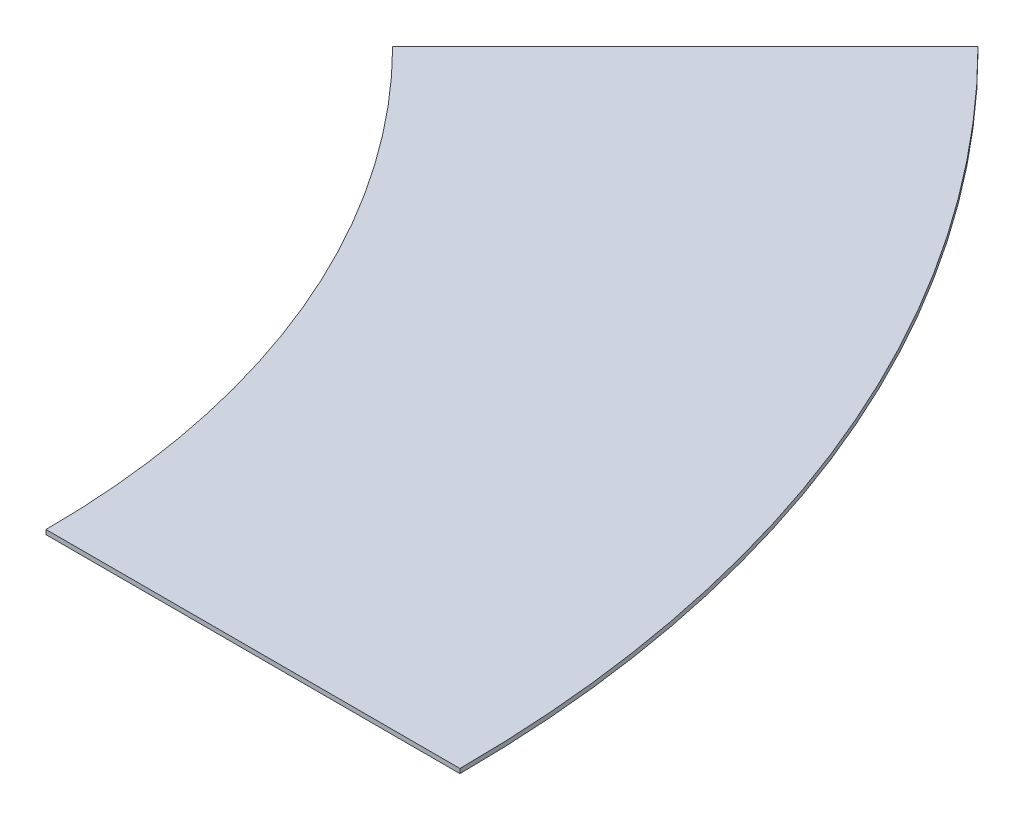
ISO-10303-21;
HEADER;
FILE_DESCRIPTION(('STEP AP214'),'2;1');
FILE_NAME('part.step','',(''),(''),'','','');
FILE_SCHEMA(('AUTOMOTIVE_DESIGN { 1 0 10303 214 1 1 1 1 }'));
ENDSEC;
DATA;
#1=APPLICATION_CONTEXT('core data for automotive mechanical design processes');
#2=APPLICATION_PROTOCOL_DEFINITION('international standard','automotive_design',2000,#1);
#3=PRODUCT_CONTEXT('',#1,'mechanical');
#4=PRODUCT('Part','Part','',(#3));
#5=PRODUCT_RELATED_PRODUCT_CATEGORY('part','',(#4));
#6=PRODUCT_DEFINITION_FORMATION('','',#4);
#7=PRODUCT_DEFINITION_CONTEXT('part definition',#1,'design');
#8=PRODUCT_DEFINITION('design','',#6,#7);
#9=PRODUCT_DEFINITION_SHAPE('','',#8);
#10=(LENGTH_UNIT() NAMED_UNIT(*) SI_UNIT(.MILLI.,.METRE.));
#11=(NAMED_UNIT(*) PLANE_ANGLE_UNIT() SI_UNIT($,.RADIAN.));
#12=(NAMED_UNIT(*) SI_UNIT($,.STERADIAN.) SOLID_ANGLE_UNIT());
#13=UNCERTAINTY_MEASURE_WITH_UNIT(LENGTH_MEASURE(1.E-05),#10,'distance_accuracy_value','');
#14=(GEOMETRIC_REPRESENTATION_CONTEXT(3) GLOBAL_UNCERTAINTY_ASSIGNED_CONTEXT((#13)) GLOBAL_UNIT_ASSIGNED_CONTEXT((#10,
#11,#12)) REPRESENTATION_CONTEXT('',''));
#15=CARTESIAN_POINT('',(0.,0.,0.));
#16=DIRECTION('',(0.,0.,1.));
#17=DIRECTION('',(1.,0.,0.));
#18=AXIS2_PLACEMENT_3D('',#15,#16,#17);
#19=CARTESIAN_POINT('',(0.,0.,0.));
#20=DIRECTION('',(0.,-1.,0.));
#21=DIRECTION('',(0.,0.,-1.));
#22=AXIS2_PLACEMENT_3D('',#19,#20,#21);
#23=CYLINDRICAL_SURFACE('',#22,930.);
#24=CARTESIAN_POINT('',(0.,2.49999999999999,0.));
#25=DIRECTION('',(0.,-1.,0.));
#26=DIRECTION('',(0.,0.,-1.));
#27=AXIS2_PLACEMENT_3D('',#24,#25,#26);
#28=CIRCLE('',#27,930.);
#29=CARTESIAN_POINT('',(657.609306503488,2.49999999999999,-657.60930650349));
#30=VERTEX_POINT('',#29);
#31=CARTESIAN_POINT('',(930.,2.49999999999999,0.));
#32=VERTEX_POINT('',#31);
#33=EDGE_CURVE('E11',#30,#32,#28,.T.);
#34=ORIENTED_EDGE('',*,*,#33,.F.);
#35=DIRECTION('',(0.,-1.,0.));
#36=VECTOR('',#35,1.);
#37=CARTESIAN_POINT('',(657.609306503488,2.49999999999999,-657.60930650349));
#38=LINE('',#37,#36);
#39=CARTESIAN_POINT('',(657.609306503488,-2.5,-657.60930650349));
#40=VERTEX_POINT('',#39);
#41=EDGE_CURVE('E87',#30,#40,#38,.T.);
#42=ORIENTED_EDGE('',*,*,#41,.T.);
#43=CARTESIAN_POINT('',(0.,-2.5,0.));
#44=DIRECTION('',(0.,-1.,0.));
#45=DIRECTION('',(0.,0.,-1.));
#46=AXIS2_PLACEMENT_3D('',#43,#44,#45);
#47=CIRCLE('',#46,930.);
#48=CARTESIAN_POINT('',(930.,-2.5,0.));
#49=VERTEX_POINT('',#48);
#50=EDGE_CURVE('E82',#40,#49,#47,.T.);
#51=ORIENTED_EDGE('',*,*,#50,.T.);
#52=DIRECTION('',(0.,-1.,0.));
#53=VECTOR('',#52,1.);
#54=CARTESIAN_POINT('',(930.,2.49999999999999,0.));
#55=LINE('',#54,#53);
#56=EDGE_CURVE('E85',#32,#49,#55,.T.);
#57=ORIENTED_EDGE('',*,*,#56,.F.);
#58=EDGE_LOOP('',(#34,#42,#51,#57));
#59=FACE_BOUND('',#58,.T.);
#60=ADVANCED_FACE('F45',(#59),#23,.F.);
#61=CARTESIAN_POINT('',(657.609306503488,2.49999999999999,-657.60930650349));
#62=DIRECTION('',(0.,-1.,0.));
#63=DIRECTION('',(0.,0.,-1.));
#64=AXIS2_PLACEMENT_3D('',#61,#62,#63);
#65=PLANE('',#64);
#66=CARTESIAN_POINT('',(0.,2.49999999999999,0.));
#67=DIRECTION('',(0.,-1.,0.));
#68=DIRECTION('',(0.,0.,-1.));
#69=AXIS2_PLACEMENT_3D('',#66,#67,#68);
#70=CIRCLE('',#69,1390.);
#71=CARTESIAN_POINT('',(982.8784258493,2.49999999999999,-982.878425849303));
#72=VERTEX_POINT('',#71);
#73=CARTESIAN_POINT('',(1390.,2.49999999999999,0.));
#74=VERTEX_POINT('',#73);
#75=EDGE_CURVE('E54',#72,#74,#70,.T.);
#76=ORIENTED_EDGE('',*,*,#75,.F.);
#77=DIRECTION('',(0.707106781186546,0.,-0.707106781186549));
#78=VECTOR('',#77,1.);
#79=CARTESIAN_POINT('',(657.609306503488,2.49999999999999,-657.60930650349));
#80=LINE('',#79,#78);
#81=EDGE_CURVE('E93',#30,#72,#80,.T.);
#82=ORIENTED_EDGE('',*,*,#81,.F.);
#83=ORIENTED_EDGE('',*,*,#33,.T.);
#84=DIRECTION('',(1.,0.,0.));
#85=VECTOR('',#84,1.);
#86=CARTESIAN_POINT('',(930.,2.49999999999999,0.));
#87=LINE('',#86,#85);
#88=EDGE_CURVE('E106',#32,#74,#87,.T.);
#89=ORIENTED_EDGE('',*,*,#88,.T.);
#90=EDGE_LOOP('',(#76,#82,#83,#89));
#91=FACE_BOUND('',#90,.T.);
#92=ADVANCED_FACE('F47',(#91),#65,.F.);
#93=CARTESIAN_POINT('',(0.,0.,0.));
#94=DIRECTION('',(0.,-1.,0.));
#95=DIRECTION('',(0.,0.,-1.));
#96=AXIS2_PLACEMENT_3D('',#93,#94,#95);
#97=CYLINDRICAL_SURFACE('',#96,1390.);
#98=CARTESIAN_POINT('',(0.,-2.49999999999971,0.));
#99=DIRECTION('',(0.,-1.,0.));
#100=DIRECTION('',(0.,0.,-1.));
#101=AXIS2_PLACEMENT_3D('',#98,#99,#100);
#102=CIRCLE('',#101,1390.);
#103=CARTESIAN_POINT('',(982.8784258493,-2.49999999999971,-982.878425849303));
#104=VERTEX_POINT('',#103);
#105=CARTESIAN_POINT('',(1390.,-2.49999999999971,0.));
#106=VERTEX_POINT('',#105);
#107=EDGE_CURVE('E92',#104,#106,#102,.T.);
#108=ORIENTED_EDGE('',*,*,#107,.F.);
#109=DIRECTION('',(0.,-1.,0.));
#110=VECTOR('',#109,1.);
#111=CARTESIAN_POINT('',(982.8784258493,2.49999999999999,-982.878425849303));
#112=LINE('',#111,#110);
#113=EDGE_CURVE('E119',#72,#104,#112,.T.);
#114=ORIENTED_EDGE('',*,*,#113,.F.);
#115=ORIENTED_EDGE('',*,*,#75,.T.);
#116=DIRECTION('',(0.,-1.,0.));
#117=VECTOR('',#116,1.);
#118=CARTESIAN_POINT('',(1390.,2.49999999999999,0.));
#119=LINE('',#118,#117);
#120=EDGE_CURVE('E102',#74,#106,#119,.T.);
#121=ORIENTED_EDGE('',*,*,#120,.T.);
#122=EDGE_LOOP('',(#108,#114,#115,#121));
#123=FACE_BOUND('',#122,.T.);
#124=ADVANCED_FACE('F129',(#123),#97,.T.);
#125=CARTESIAN_POINT('',(982.8784258493,-2.49999999999986,-982.878425849303));
#126=DIRECTION('',(0.,1.,0.));
#127=DIRECTION('',(0.,0.,1.));
#128=AXIS2_PLACEMENT_3D('',#125,#126,#127);
#129=PLANE('',#128);
#130=DIRECTION('',(-0.707106781186546,0.,0.707106781186549));
#131=VECTOR('',#130,1.);
#132=CARTESIAN_POINT('',(982.8784258493,-2.49999999999971,-982.878425849303));
#133=LINE('',#132,#131);
#134=EDGE_CURVE('E116',#104,#40,#133,.T.);
#135=ORIENTED_EDGE('',*,*,#134,.F.);
#136=ORIENTED_EDGE('',*,*,#107,.T.);
#137=DIRECTION('',(-1.,0.,0.));
#138=VECTOR('',#137,1.);
#139=CARTESIAN_POINT('',(1390.,-2.49999999999971,0.));
#140=LINE('',#139,#138);
#141=EDGE_CURVE('E96',#106,#49,#140,.T.);
#142=ORIENTED_EDGE('',*,*,#141,.T.);
#143=ORIENTED_EDGE('',*,*,#50,.F.);
#144=EDGE_LOOP('',(#135,#136,#142,#143));
#145=FACE_BOUND('',#144,.T.);
#146=ADVANCED_FACE('F97',(#145),#129,.F.);
#147=CARTESIAN_POINT('',(0.,0.,0.));
#148=DIRECTION('',(-0.707106781186549,0.,-0.707106781186546));
#149=DIRECTION('',(-0.707106781186546,0.,0.707106781186549));
#150=AXIS2_PLACEMENT_3D('',#147,#148,#149);
#151=PLANE('',#150);
#152=ORIENTED_EDGE('',*,*,#41,.F.);
#153=ORIENTED_EDGE('',*,*,#81,.T.);
#154=ORIENTED_EDGE('',*,*,#113,.T.);
#155=ORIENTED_EDGE('',*,*,#134,.T.);
#156=EDGE_LOOP('',(#152,#153,#154,#155));
#157=FACE_BOUND('',#156,.T.);
#158=ADVANCED_FACE('F131',(#157),#151,.T.);
#159=CARTESIAN_POINT('',(0.,0.,0.));
#160=DIRECTION('',(0.,0.,-1.));
#161=DIRECTION('',(-1.,0.,0.));
#162=AXIS2_PLACEMENT_3D('',#159,#160,#161);
#163=PLANE('',#162);
#164=ORIENTED_EDGE('',*,*,#56,.T.);
#165=ORIENTED_EDGE('',*,*,#141,.F.);
#166=ORIENTED_EDGE('',*,*,#120,.F.);
#167=ORIENTED_EDGE('',*,*,#88,.F.);
#168=EDGE_LOOP('',(#164,#165,#166,#167));
#169=FACE_BOUND('',#168,.T.);
#170=ADVANCED_FACE('F105',(#169),#163,.F.);
#171=CLOSED_SHELL('',(#60,#92,#124,#146,#158,#170));
#172=MANIFOLD_SOLID_BREP('B2',#171);
#173=ADVANCED_BREP_SHAPE_REPRESENTATION('',(#18,#172),#14);
#174=SHAPE_DEFINITION_REPRESENTATION(#9,#173);
ENDSEC;
END-ISO-10303-21;
